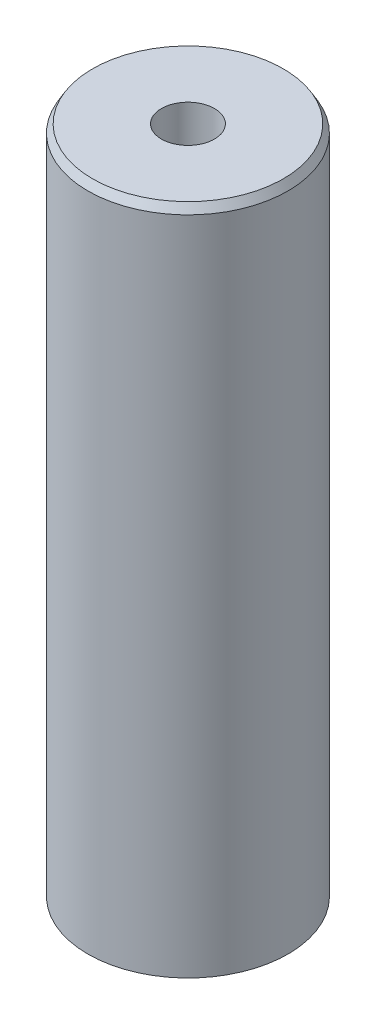
ISO-10303-21;
HEADER;
FILE_DESCRIPTION(('STEP AP214'),'2;1');
FILE_NAME('part.step','',(''),(''),'','','');
FILE_SCHEMA(('AUTOMOTIVE_DESIGN { 1 0 10303 214 1 1 1 1 }'));
ENDSEC;
DATA;
#1=APPLICATION_CONTEXT('core data for automotive mechanical design processes');
#2=APPLICATION_PROTOCOL_DEFINITION('international standard','automotive_design',2000,#1);
#3=PRODUCT_CONTEXT('',#1,'mechanical');
#4=PRODUCT('Part','Part','',(#3));
#5=PRODUCT_RELATED_PRODUCT_CATEGORY('part','',(#4));
#6=PRODUCT_DEFINITION_FORMATION('','',#4);
#7=PRODUCT_DEFINITION_CONTEXT('part definition',#1,'design');
#8=PRODUCT_DEFINITION('design','',#6,#7);
#9=PRODUCT_DEFINITION_SHAPE('','',#8);
#10=(LENGTH_UNIT() NAMED_UNIT(*) SI_UNIT(.MILLI.,.METRE.));
#11=(NAMED_UNIT(*) PLANE_ANGLE_UNIT() SI_UNIT($,.RADIAN.));
#12=(NAMED_UNIT(*) SI_UNIT($,.STERADIAN.) SOLID_ANGLE_UNIT());
#13=UNCERTAINTY_MEASURE_WITH_UNIT(LENGTH_MEASURE(1.E-05),#10,'distance_accuracy_value','');
#14=(GEOMETRIC_REPRESENTATION_CONTEXT(3) GLOBAL_UNCERTAINTY_ASSIGNED_CONTEXT((#13)) GLOBAL_UNIT_ASSIGNED_CONTEXT((#10,
#11,#12)) REPRESENTATION_CONTEXT('',''));
#15=CARTESIAN_POINT('',(0.,0.,0.));
#16=DIRECTION('',(0.,0.,1.));
#17=DIRECTION('',(1.,0.,0.));
#18=AXIS2_PLACEMENT_3D('',#15,#16,#17);
#19=CARTESIAN_POINT('',(0.,84.1664383384446,0.));
#20=DIRECTION('',(0.,-1.,0.));
#21=DIRECTION('',(0.,0.,-1.));
#22=AXIS2_PLACEMENT_3D('',#19,#20,#21);
#23=CYLINDRICAL_SURFACE('',#22,12.5);
#24=CARTESIAN_POINT('',(0.,83.1493662335155,0.));
#25=DIRECTION('',(0.,1.,0.));
#26=DIRECTION('',(0.,0.,1.));
#27=AXIS2_PLACEMENT_3D('',#24,#25,#26);
#28=CIRCLE('',#27,12.5);
#29=CARTESIAN_POINT('',(0.,83.1493662335155,12.5));
#30=VERTEX_POINT('',#29);
#31=EDGE_CURVE('E50',#30,#30,#28,.F.);
#32=ORIENTED_EDGE('',*,*,#31,.T.);
#33=EDGE_LOOP('',(#32));
#34=FACE_BOUND('',#33,.T.);
#35=CARTESIAN_POINT('',(0.,0.587206853566086,0.));
#36=DIRECTION('',(0.,1.,0.));
#37=DIRECTION('',(0.,0.,1.));
#38=AXIS2_PLACEMENT_3D('',#35,#36,#37);
#39=CIRCLE('',#38,12.5);
#40=CARTESIAN_POINT('',(0.,0.587206853566086,12.5));
#41=VERTEX_POINT('',#40);
#42=EDGE_CURVE('E51',#41,#41,#39,.T.);
#43=ORIENTED_EDGE('',*,*,#42,.T.);
#44=EDGE_LOOP('',(#43));
#45=FACE_BOUND('',#44,.T.);
#46=ADVANCED_FACE('F39',(#34,#45),#23,.T.);
#47=CARTESIAN_POINT('',(0.,84.1664383384446,0.));
#48=DIRECTION('',(0.,1.,0.));
#49=DIRECTION('',(0.,0.,1.));
#50=AXIS2_PLACEMENT_3D('',#47,#48,#49);
#51=PLANE('',#50);
#52=CARTESIAN_POINT('',(0.,84.1664383384446,0.));
#53=DIRECTION('',(0.,1.,0.));
#54=DIRECTION('',(0.,0.,1.));
#55=AXIS2_PLACEMENT_3D('',#52,#53,#54);
#56=CIRCLE('',#55,11.9127931464339);
#57=CARTESIAN_POINT('',(0.,84.1664383384446,11.9127931464339));
#58=VERTEX_POINT('',#57);
#59=EDGE_CURVE('E54',#58,#58,#56,.T.);
#60=ORIENTED_EDGE('',*,*,#59,.T.);
#61=EDGE_LOOP('',(#60));
#62=FACE_BOUND('',#61,.T.);
#63=CARTESIAN_POINT('',(0.,84.1664383384446,0.));
#64=DIRECTION('',(0.,1.,0.));
#65=DIRECTION('',(0.,0.,1.));
#66=AXIS2_PLACEMENT_3D('',#63,#64,#65);
#67=CIRCLE('',#66,3.31213486420962);
#68=CARTESIAN_POINT('',(0.,84.1664383384446,3.31213486420962));
#69=VERTEX_POINT('',#68);
#70=EDGE_CURVE('E58',#69,#69,#67,.T.);
#71=ORIENTED_EDGE('',*,*,#70,.F.);
#72=EDGE_LOOP('',(#71));
#73=FACE_BOUND('',#72,.T.);
#74=ADVANCED_FACE('F69',(#62,#73),#51,.T.);
#75=CARTESIAN_POINT('',(0.,0.,0.));
#76=DIRECTION('',(0.,1.,0.));
#77=DIRECTION('',(0.,0.,1.));
#78=AXIS2_PLACEMENT_3D('',#75,#76,#77);
#79=PLANE('',#78);
#80=CARTESIAN_POINT('',(0.,0.,0.));
#81=DIRECTION('',(0.,1.,0.));
#82=DIRECTION('',(0.,0.,1.));
#83=AXIS2_PLACEMENT_3D('',#80,#81,#82);
#84=CIRCLE('',#83,11.4829278950709);
#85=CARTESIAN_POINT('',(0.,0.,11.4829278950709));
#86=VERTEX_POINT('',#85);
#87=EDGE_CURVE('E10',#86,#86,#84,.F.);
#88=ORIENTED_EDGE('',*,*,#87,.T.);
#89=EDGE_LOOP('',(#88));
#90=FACE_BOUND('',#89,.T.);
#91=CARTESIAN_POINT('',(0.,0.,0.));
#92=DIRECTION('',(0.,1.,0.));
#93=DIRECTION('',(0.,0.,1.));
#94=AXIS2_PLACEMENT_3D('',#91,#92,#93);
#95=CIRCLE('',#94,3.31213486420962);
#96=CARTESIAN_POINT('',(0.,0.,3.31213486420962));
#97=VERTEX_POINT('',#96);
#98=EDGE_CURVE('E63',#97,#97,#95,.T.);
#99=ORIENTED_EDGE('',*,*,#98,.T.);
#100=EDGE_LOOP('',(#99));
#101=FACE_BOUND('',#100,.T.);
#102=ADVANCED_FACE('F75',(#90,#101),#79,.F.);
#103=CARTESIAN_POINT('',(0.,84.1664383384446,0.));
#104=DIRECTION('',(0.,-1.,0.));
#105=DIRECTION('',(0.,0.,-1.));
#106=AXIS2_PLACEMENT_3D('',#103,#104,#105);
#107=CYLINDRICAL_SURFACE('',#106,3.31213486420962);
#108=ORIENTED_EDGE('',*,*,#70,.T.);
#109=EDGE_LOOP('',(#108));
#110=FACE_BOUND('',#109,.T.);
#111=ORIENTED_EDGE('',*,*,#98,.F.);
#112=EDGE_LOOP('',(#111));
#113=FACE_BOUND('',#112,.T.);
#114=ADVANCED_FACE('F70',(#110,#113),#107,.F.);
#115=CARTESIAN_POINT('',(0.,84.1664383384446,0.));
#116=DIRECTION('',(0.,-1.,0.));
#117=DIRECTION('',(0.,0.,-1.));
#118=AXIS2_PLACEMENT_3D('',#115,#116,#117);
#119=CONICAL_SURFACE('',#118,11.9127931464339,0.523598775598294);
#120=ORIENTED_EDGE('',*,*,#31,.F.);
#121=EDGE_LOOP('',(#120));
#122=FACE_BOUND('',#121,.T.);
#123=ORIENTED_EDGE('',*,*,#59,.F.);
#124=EDGE_LOOP('',(#123));
#125=FACE_BOUND('',#124,.T.);
#126=ADVANCED_FACE('F81',(#122,#125),#119,.T.);
#127=CARTESIAN_POINT('',(0.,0.587206853566086,0.));
#128=DIRECTION('',(0.,1.,0.));
#129=DIRECTION('',(0.,0.,1.));
#130=AXIS2_PLACEMENT_3D('',#127,#128,#129);
#131=CONICAL_SURFACE('',#130,12.5,1.0471975511966);
#132=ORIENTED_EDGE('',*,*,#87,.F.);
#133=EDGE_LOOP('',(#132));
#134=FACE_BOUND('',#133,.T.);
#135=ORIENTED_EDGE('',*,*,#42,.F.);
#136=EDGE_LOOP('',(#135));
#137=FACE_BOUND('',#136,.T.);
#138=ADVANCED_FACE('F45',(#134,#137),#131,.T.);
#139=CLOSED_SHELL('',(#46,#74,#102,#114,#126,#138));
#140=MANIFOLD_SOLID_BREP('B2',#139);
#141=ADVANCED_BREP_SHAPE_REPRESENTATION('',(#18,#140),#14);
#142=SHAPE_DEFINITION_REPRESENTATION(#9,#141);
ENDSEC;
END-ISO-10303-21;
